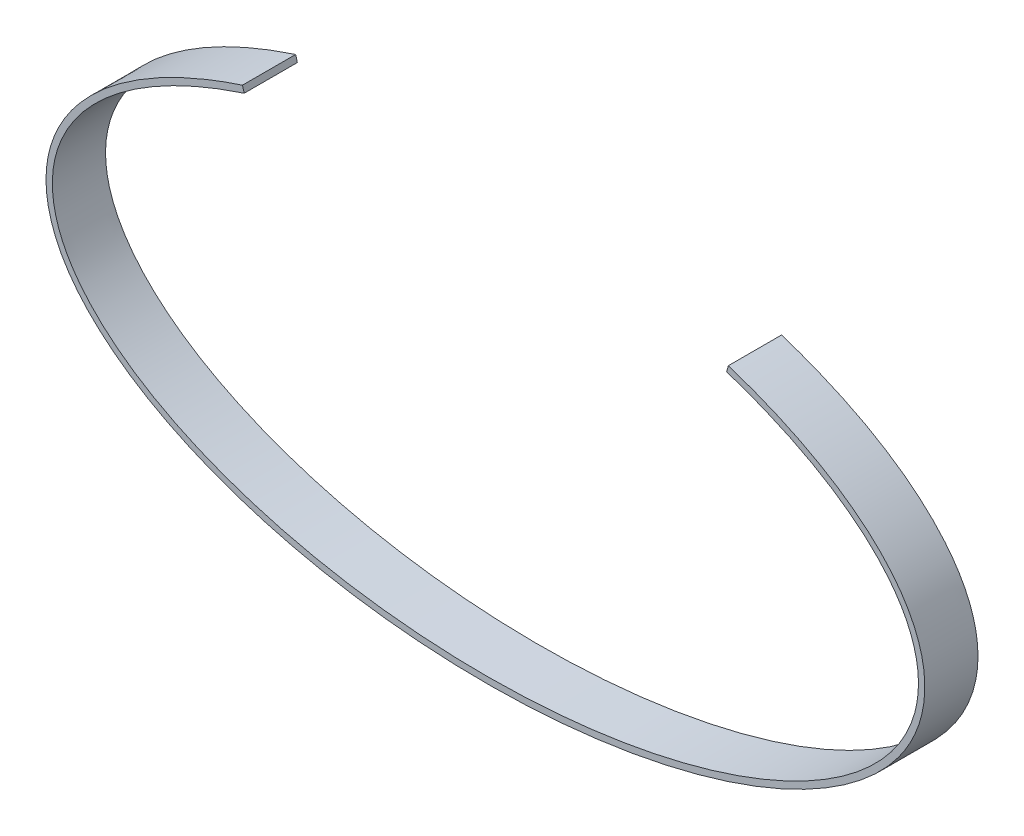
ISO-10303-21;
HEADER;
FILE_DESCRIPTION(('STEP AP214'),'2;1');
FILE_NAME('part.step','',(''),(''),'','','');
FILE_SCHEMA(('AUTOMOTIVE_DESIGN { 1 0 10303 214 1 1 1 1 }'));
ENDSEC;
DATA;
#1=APPLICATION_CONTEXT('core data for automotive mechanical design processes');
#2=APPLICATION_PROTOCOL_DEFINITION('international standard','automotive_design',2000,#1);
#3=PRODUCT_CONTEXT('',#1,'mechanical');
#4=PRODUCT('Part','Part','',(#3));
#5=PRODUCT_RELATED_PRODUCT_CATEGORY('part','',(#4));
#6=PRODUCT_DEFINITION_FORMATION('','',#4);
#7=PRODUCT_DEFINITION_CONTEXT('part definition',#1,'design');
#8=PRODUCT_DEFINITION('design','',#6,#7);
#9=PRODUCT_DEFINITION_SHAPE('','',#8);
#10=(LENGTH_UNIT() NAMED_UNIT(*) SI_UNIT(.MILLI.,.METRE.));
#11=(NAMED_UNIT(*) PLANE_ANGLE_UNIT() SI_UNIT($,.RADIAN.));
#12=(NAMED_UNIT(*) SI_UNIT($,.STERADIAN.) SOLID_ANGLE_UNIT());
#13=UNCERTAINTY_MEASURE_WITH_UNIT(LENGTH_MEASURE(1.E-05),#10,'distance_accuracy_value','');
#14=(GEOMETRIC_REPRESENTATION_CONTEXT(3) GLOBAL_UNCERTAINTY_ASSIGNED_CONTEXT((#13)) GLOBAL_UNIT_ASSIGNED_CONTEXT((#10,
#11,#12)) REPRESENTATION_CONTEXT('',''));
#15=CARTESIAN_POINT('',(0.,0.,0.));
#16=DIRECTION('',(0.,0.,1.));
#17=DIRECTION('',(1.,0.,0.));
#18=AXIS2_PLACEMENT_3D('',#15,#16,#17);
#19=CARTESIAN_POINT('',(22.6712230194547,18.0351357951931,5.));
#20=CARTESIAN_POINT('',(23.1244508687197,17.8875552362047,5.));
#21=CARTESIAN_POINT('',(23.57338151497,17.7350929178389,5.));
#22=CARTESIAN_POINT('',(24.4537774093582,17.4230232898924,5.));
#23=CARTESIAN_POINT('',(24.8858285439626,17.2632494265172,5.));
#24=CARTESIAN_POINT('',(26.1597332283695,16.7721659699781,5.));
#25=CARTESIAN_POINT('',(26.9805785009848,16.4286955420237,5.));
#26=CARTESIAN_POINT('',(29.3596017613618,15.3507912507727,5.));
#27=CARTESIAN_POINT('',(30.8297471816024,14.5701438243256,5.));
#28=CARTESIAN_POINT('',(34.8181438801696,12.0780162322035,5.));
#29=CARTESIAN_POINT('',(36.9182334441817,10.2139714392686,5.));
#30=CARTESIAN_POINT('',(39.0800518659044,7.26750831120165,5.));
#31=CARTESIAN_POINT('',(39.6373460145538,6.26091734109245,5.));
#32=CARTESIAN_POINT('',(40.414776524331,4.22586311014038,5.));
#33=CARTESIAN_POINT('',(40.6353699428487,3.19644394935072,5.));
#34=CARTESIAN_POINT('',(40.7415384284368,1.1322835493168,5.));
#35=CARTESIAN_POINT('',(40.6259718573775,0.0977228869266621,5.));
#36=CARTESIAN_POINT('',(40.0555236438091,-1.95052607881685,5.));
#37=CARTESIAN_POINT('',(39.6008544775974,-2.96429641785395,5.));
#38=CARTESIAN_POINT('',(37.7376407983355,-5.94873835389215,5.));
#39=CARTESIAN_POINT('',(35.836625242314,-7.86028728853731,5.));
#40=CARTESIAN_POINT('',(30.8680871579794,-11.3032590486715,5.));
#41=CARTESIAN_POINT('',(27.8064396630751,-12.8350281149432,5.));
#42=CARTESIAN_POINT('',(20.8401444541609,-15.3549118310755,5.));
#43=CARTESIAN_POINT('',(16.9384275688805,-16.3431734676818,5.));
#44=CARTESIAN_POINT('',(8.69009281811614,-17.6723450044211,5.));
#45=CARTESIAN_POINT('',(4.34542626583159,-18.0135393297491,5.));
#46=CARTESIAN_POINT('',(-4.34542626669103,-18.013539329749,5.));
#47=CARTESIAN_POINT('',(-8.69009281897026,-17.6723450044213,5.));
#48=CARTESIAN_POINT('',(-16.9384275697135,-16.3431734676818,5.));
#49=CARTESIAN_POINT('',(-20.8401444549785,-15.354911831076,5.));
#50=CARTESIAN_POINT('',(-27.8064396638526,-12.8350281149436,5.));
#51=CARTESIAN_POINT('',(-30.8680871587329,-11.3032590486724,5.));
#52=CARTESIAN_POINT('',(-35.836625243012,-7.86028728853864,5.));
#53=CARTESIAN_POINT('',(-37.7376407990035,-5.94873835389446,5.));
#54=CARTESIAN_POINT('',(-39.600854478218,-2.96429641785798,5.));
#55=CARTESIAN_POINT('',(-40.0555236444134,-1.95052607882131,5.));
#56=CARTESIAN_POINT('',(-40.6259718579495,0.097722886921961,5.));
#57=CARTESIAN_POINT('',(-40.7415384289924,1.13228354931211,5.));
#58=CARTESIAN_POINT('',(-40.6353699433723,3.19644394934589,5.));
#59=CARTESIAN_POINT('',(-40.4147765248387,4.22586311013568,5.));
#60=CARTESIAN_POINT('',(-39.6373460150292,6.26091734108862,5.));
#61=CARTESIAN_POINT('',(-39.0800518663639,7.26750831119842,5.));
#62=CARTESIAN_POINT('',(-36.9182334445943,10.2139714392667,5.));
#63=CARTESIAN_POINT('',(-34.8181438805525,12.0780162322021,5.));
#64=CARTESIAN_POINT('',(-30.8297471819453,14.5701438243249,5.));
#65=CARTESIAN_POINT('',(-29.3596017616921,15.3507912507722,5.));
#66=CARTESIAN_POINT('',(-26.9805785012987,16.4286955420231,5.));
#67=CARTESIAN_POINT('',(-26.1597332286786,16.7721659699773,5.));
#68=CARTESIAN_POINT('',(-24.885828544263,17.2632494265167,5.));
#69=CARTESIAN_POINT('',(-24.4537774096555,17.4230232898921,5.));
#70=CARTESIAN_POINT('',(-23.5733815152606,17.7350929178392,5.));
#71=CARTESIAN_POINT('',(-23.1244508690074,17.8875552362052,5.));
#72=CARTESIAN_POINT('',(-22.6712230197411,18.0351357951933,5.));
#73=B_SPLINE_CURVE_WITH_KNOTS('',3,(#19,#20,#21,#22,#23,#24,#25,#26,#27,#28,#29,#30,#31,#32,#33,
#34,#35,#36,#37,#38,#39,#40,#41,#42,#43,#44,#45,#46,#47,#48,#49,#50,#51,#52,#53,#54,#55,#56,#57,
#58,#59,#60,#61,#62,#63,#64,#65,#66,#67,#68,#69,#70,#71,#72),.UNSPECIFIED.,.F.,.F.,(4,2,2,2,2,2,
2,2,2,2,2,2,2,2,2,2,2,2,2,2,2,2,2,2,2,2,4),(0.,0.00781249999999989,0.0156249999999999,0.03125,
0.0625000000000001,0.125,0.15625,0.1875,0.21875,0.250000000000001,0.312500000000001,
0.375000000000001,0.4375,0.5,0.5625,0.625,0.6875,0.75,0.78125,0.8125,0.84375,0.875,0.9375,
0.96875,0.984375,0.9921875,1.),.UNSPECIFIED.);
#74=DIRECTION('',(0.,0.,-1.));
#75=VECTOR('',#74,1.);
#76=SURFACE_OF_LINEAR_EXTRUSION('',#73,#75);
#77=CARTESIAN_POINT('',(22.6712230194547,18.0351357951931,0.));
#78=CARTESIAN_POINT('',(23.1244508687197,17.8875552362047,0.));
#79=CARTESIAN_POINT('',(23.57338151497,17.7350929178389,0.));
#80=CARTESIAN_POINT('',(24.4537774093582,17.4230232898924,0.));
#81=CARTESIAN_POINT('',(24.8858285439626,17.2632494265172,0.));
#82=CARTESIAN_POINT('',(26.1597332283695,16.7721659699781,0.));
#83=CARTESIAN_POINT('',(26.9805785009848,16.4286955420237,0.));
#84=CARTESIAN_POINT('',(29.3596017613618,15.3507912507727,0.));
#85=CARTESIAN_POINT('',(30.8297471816024,14.5701438243256,0.));
#86=CARTESIAN_POINT('',(34.8181438801696,12.0780162322035,0.));
#87=CARTESIAN_POINT('',(36.9182334441817,10.2139714392686,0.));
#88=CARTESIAN_POINT('',(39.0800518659044,7.26750831120165,0.));
#89=CARTESIAN_POINT('',(39.6373460145538,6.26091734109245,0.));
#90=CARTESIAN_POINT('',(40.414776524331,4.22586311014038,0.));
#91=CARTESIAN_POINT('',(40.6353699428487,3.19644394935072,0.));
#92=CARTESIAN_POINT('',(40.7415384284368,1.1322835493168,0.));
#93=CARTESIAN_POINT('',(40.6259718573775,0.0977228869266621,0.));
#94=CARTESIAN_POINT('',(40.0555236438091,-1.95052607881685,0.));
#95=CARTESIAN_POINT('',(39.6008544775974,-2.96429641785395,0.));
#96=CARTESIAN_POINT('',(37.7376407983355,-5.94873835389215,0.));
#97=CARTESIAN_POINT('',(35.836625242314,-7.86028728853731,0.));
#98=CARTESIAN_POINT('',(30.8680871579794,-11.3032590486715,0.));
#99=CARTESIAN_POINT('',(27.8064396630751,-12.8350281149432,0.));
#100=CARTESIAN_POINT('',(20.8401444541609,-15.3549118310755,0.));
#101=CARTESIAN_POINT('',(16.9384275688805,-16.3431734676818,0.));
#102=CARTESIAN_POINT('',(8.69009281811614,-17.6723450044211,0.));
#103=CARTESIAN_POINT('',(4.34542626583159,-18.0135393297491,0.));
#104=CARTESIAN_POINT('',(-4.34542626669103,-18.013539329749,0.));
#105=CARTESIAN_POINT('',(-8.69009281897026,-17.6723450044213,0.));
#106=CARTESIAN_POINT('',(-16.9384275697135,-16.3431734676818,0.));
#107=CARTESIAN_POINT('',(-20.8401444549785,-15.354911831076,0.));
#108=CARTESIAN_POINT('',(-27.8064396638526,-12.8350281149436,0.));
#109=CARTESIAN_POINT('',(-30.8680871587329,-11.3032590486724,0.));
#110=CARTESIAN_POINT('',(-35.836625243012,-7.86028728853864,0.));
#111=CARTESIAN_POINT('',(-37.7376407990035,-5.94873835389446,0.));
#112=CARTESIAN_POINT('',(-39.600854478218,-2.96429641785798,0.));
#113=CARTESIAN_POINT('',(-40.0555236444134,-1.95052607882131,0.));
#114=CARTESIAN_POINT('',(-40.6259718579495,0.097722886921961,0.));
#115=CARTESIAN_POINT('',(-40.7415384289924,1.13228354931211,0.));
#116=CARTESIAN_POINT('',(-40.6353699433723,3.19644394934589,0.));
#117=CARTESIAN_POINT('',(-40.4147765248387,4.22586311013568,0.));
#118=CARTESIAN_POINT('',(-39.6373460150292,6.26091734108862,0.));
#119=CARTESIAN_POINT('',(-39.0800518663639,7.26750831119842,0.));
#120=CARTESIAN_POINT('',(-36.9182334445943,10.2139714392667,0.));
#121=CARTESIAN_POINT('',(-34.8181438805525,12.0780162322021,0.));
#122=CARTESIAN_POINT('',(-30.8297471819453,14.5701438243249,0.));
#123=CARTESIAN_POINT('',(-29.3596017616921,15.3507912507722,0.));
#124=CARTESIAN_POINT('',(-26.9805785012987,16.4286955420231,0.));
#125=CARTESIAN_POINT('',(-26.1597332286786,16.7721659699773,0.));
#126=CARTESIAN_POINT('',(-24.885828544263,17.2632494265167,0.));
#127=CARTESIAN_POINT('',(-24.4537774096555,17.4230232898921,0.));
#128=CARTESIAN_POINT('',(-23.5733815152606,17.7350929178392,0.));
#129=CARTESIAN_POINT('',(-23.1244508690074,17.8875552362052,0.));
#130=CARTESIAN_POINT('',(-22.6712230197411,18.0351357951933,0.));
#131=B_SPLINE_CURVE_WITH_KNOTS('',3,(#77,#78,#79,#80,#81,#82,#83,#84,#85,#86,#87,#88,#89,#90,
#91,#92,#93,#94,#95,#96,#97,#98,#99,#100,#101,#102,#103,#104,#105,#106,#107,#108,#109,#110,#111,
#112,#113,#114,#115,#116,#117,#118,#119,#120,#121,#122,#123,#124,#125,#126,#127,#128,#129,#130),
.UNSPECIFIED.,.F.,.F.,(4,2,2,2,2,2,2,2,2,2,2,2,2,2,2,2,2,2,2,2,2,2,2,2,2,2,4),(0.,
0.00781249999999989,0.0156249999999999,0.03125,0.0625000000000001,0.125,0.15625,0.1875,0.21875,
0.250000000000001,0.312500000000001,0.375000000000001,0.4375,0.5,0.5625,0.625,0.6875,0.75,
0.78125,0.8125,0.84375,0.875,0.9375,0.96875,0.984375,0.9921875,1.),.UNSPECIFIED.);
#132=CARTESIAN_POINT('',(22.6712230194548,18.0351357951931,0.));
#133=VERTEX_POINT('',#132);
#134=CARTESIAN_POINT('',(-22.6712230197411,18.0351357951933,0.));
#135=VERTEX_POINT('',#134);
#136=EDGE_CURVE('E200',#133,#135,#131,.T.);
#137=ORIENTED_EDGE('',*,*,#136,.T.);
#138=DIRECTION('',(0.,0.,-1.));
#139=VECTOR('',#138,1.);
#140=CARTESIAN_POINT('',(-22.6712230197411,18.0351357951933,5.));
#141=LINE('',#140,#139);
#142=CARTESIAN_POINT('',(-22.6712230197411,18.0351357951933,5.));
#143=VERTEX_POINT('',#142);
#144=EDGE_CURVE('E11',#143,#135,#141,.T.);
#145=ORIENTED_EDGE('',*,*,#144,.F.);
#146=CARTESIAN_POINT('',(-22.6712230197411,18.0351357951933,5.));
#147=CARTESIAN_POINT('',(-23.1244508690074,17.8875552362052,5.));
#148=CARTESIAN_POINT('',(-23.5733815152606,17.7350929178392,5.));
#149=CARTESIAN_POINT('',(-24.4537774096555,17.4230232898921,5.));
#150=CARTESIAN_POINT('',(-24.885828544263,17.2632494265167,5.));
#151=CARTESIAN_POINT('',(-26.1597332286786,16.7721659699773,5.));
#152=CARTESIAN_POINT('',(-26.9805785012987,16.4286955420231,5.));
#153=CARTESIAN_POINT('',(-29.3596017616921,15.3507912507722,5.));
#154=CARTESIAN_POINT('',(-30.8297471819453,14.5701438243249,5.));
#155=CARTESIAN_POINT('',(-34.8181438805525,12.0780162322021,5.));
#156=CARTESIAN_POINT('',(-36.9182334445943,10.2139714392667,5.));
#157=CARTESIAN_POINT('',(-39.0800518663639,7.26750831119842,5.));
#158=CARTESIAN_POINT('',(-39.6373460150292,6.26091734108862,5.));
#159=CARTESIAN_POINT('',(-40.4147765248387,4.22586311013568,5.));
#160=CARTESIAN_POINT('',(-40.6353699433723,3.19644394934589,5.));
#161=CARTESIAN_POINT('',(-40.7415384289924,1.13228354931211,5.));
#162=CARTESIAN_POINT('',(-40.6259718579495,0.097722886921961,5.));
#163=CARTESIAN_POINT('',(-40.0555236444134,-1.95052607882131,5.));
#164=CARTESIAN_POINT('',(-39.600854478218,-2.96429641785798,5.));
#165=CARTESIAN_POINT('',(-37.7376407990035,-5.94873835389446,5.));
#166=CARTESIAN_POINT('',(-35.836625243012,-7.86028728853864,5.));
#167=CARTESIAN_POINT('',(-30.8680871587329,-11.3032590486724,5.));
#168=CARTESIAN_POINT('',(-27.8064396638526,-12.8350281149436,5.));
#169=CARTESIAN_POINT('',(-20.8401444549785,-15.354911831076,5.));
#170=CARTESIAN_POINT('',(-16.9384275697135,-16.3431734676818,5.));
#171=CARTESIAN_POINT('',(-8.69009281897026,-17.6723450044213,5.));
#172=CARTESIAN_POINT('',(-4.34542626669103,-18.013539329749,5.));
#173=CARTESIAN_POINT('',(4.34542626583159,-18.0135393297491,5.));
#174=CARTESIAN_POINT('',(8.69009281811614,-17.6723450044211,5.));
#175=CARTESIAN_POINT('',(16.9384275688805,-16.3431734676818,5.));
#176=CARTESIAN_POINT('',(20.8401444541609,-15.3549118310755,5.));
#177=CARTESIAN_POINT('',(27.8064396630751,-12.8350281149432,5.));
#178=CARTESIAN_POINT('',(30.8680871579794,-11.3032590486715,5.));
#179=CARTESIAN_POINT('',(35.836625242314,-7.86028728853731,5.));
#180=CARTESIAN_POINT('',(37.7376407983355,-5.94873835389215,5.));
#181=CARTESIAN_POINT('',(39.6008544775974,-2.96429641785395,5.));
#182=CARTESIAN_POINT('',(40.0555236438091,-1.95052607881685,5.));
#183=CARTESIAN_POINT('',(40.6259718573775,0.0977228869266621,5.));
#184=CARTESIAN_POINT('',(40.7415384284368,1.1322835493168,5.));
#185=CARTESIAN_POINT('',(40.6353699428487,3.19644394935072,5.));
#186=CARTESIAN_POINT('',(40.414776524331,4.22586311014038,5.));
#187=CARTESIAN_POINT('',(39.6373460145538,6.26091734109245,5.));
#188=CARTESIAN_POINT('',(39.0800518659044,7.26750831120165,5.));
#189=CARTESIAN_POINT('',(36.9182334441817,10.2139714392686,5.));
#190=CARTESIAN_POINT('',(34.8181438801696,12.0780162322035,5.));
#191=CARTESIAN_POINT('',(30.8297471816024,14.5701438243256,5.));
#192=CARTESIAN_POINT('',(29.3596017613618,15.3507912507727,5.));
#193=CARTESIAN_POINT('',(26.9805785009848,16.4286955420237,5.));
#194=CARTESIAN_POINT('',(26.1597332283695,16.7721659699781,5.));
#195=CARTESIAN_POINT('',(24.8858285439626,17.2632494265172,5.));
#196=CARTESIAN_POINT('',(24.4537774093582,17.4230232898924,5.));
#197=CARTESIAN_POINT('',(23.57338151497,17.7350929178389,5.));
#198=CARTESIAN_POINT('',(23.1244508687197,17.8875552362047,5.));
#199=CARTESIAN_POINT('',(22.6712230194547,18.0351357951931,5.));
#200=B_SPLINE_CURVE_WITH_KNOTS('',3,(#146,#147,#148,#149,#150,#151,#152,#153,#154,#155,#156,
#157,#158,#159,#160,#161,#162,#163,#164,#165,#166,#167,#168,#169,#170,#171,#172,#173,#174,#175,
#176,#177,#178,#179,#180,#181,#182,#183,#184,#185,#186,#187,#188,#189,#190,#191,#192,#193,#194,
#195,#196,#197,#198,#199),.UNSPECIFIED.,.F.,.F.,(4,2,2,2,2,2,2,2,2,2,2,2,2,2,2,2,2,2,2,2,2,2,2,
2,2,2,4),(0.,0.0078125,0.015625,0.03125,0.0625,0.125,0.15625,0.1875,0.21875,0.25,0.3125,0.375,
0.4375,0.5,0.5625,0.624999999999999,0.687499999999999,0.749999999999999,0.78125,0.8125,0.84375,
0.875,0.9375,0.96875,0.984375,0.9921875,1.),.UNSPECIFIED.);
#201=CARTESIAN_POINT('',(22.6712230194548,18.0351357951931,5.));
#202=VERTEX_POINT('',#201);
#203=EDGE_CURVE('E97',#202,#143,#200,.F.);
#204=ORIENTED_EDGE('',*,*,#203,.F.);
#205=DIRECTION('',(0.,0.,-1.));
#206=VECTOR('',#205,1.);
#207=CARTESIAN_POINT('',(22.6712230194548,18.0351357951931,5.));
#208=LINE('',#207,#206);
#209=EDGE_CURVE('E185',#202,#133,#208,.T.);
#210=ORIENTED_EDGE('',*,*,#209,.T.);
#211=EDGE_LOOP('',(#137,#145,#204,#210));
#212=FACE_BOUND('',#211,.T.);
#213=ADVANCED_FACE('F37',(#212),#76,.F.);
#214=CARTESIAN_POINT('',(-22.8326998065958,18.6135575800608,5.));
#215=DIRECTION('',(-0.963171829425623,-0.268886643403681,0.));
#216=DIRECTION('',(0.268886643403681,-0.963171829425623,0.));
#217=AXIS2_PLACEMENT_3D('',#214,#215,#216);
#218=PLANE('',#217);
#219=DIRECTION('',(-0.268886643403681,0.963171829425623,0.));
#220=VECTOR('',#219,1.);
#221=CARTESIAN_POINT('',(-22.8326998065958,18.6135575800608,0.));
#222=LINE('',#221,#220);
#223=CARTESIAN_POINT('',(-22.8326998065958,18.6135575800608,0.));
#224=VERTEX_POINT('',#223);
#225=EDGE_CURVE('E103',#135,#224,#222,.T.);
#226=ORIENTED_EDGE('',*,*,#225,.T.);
#227=DIRECTION('',(0.,0.,-1.));
#228=VECTOR('',#227,1.);
#229=CARTESIAN_POINT('',(-22.8326998065958,18.6135575800608,5.));
#230=LINE('',#229,#228);
#231=CARTESIAN_POINT('',(-22.8326998065958,18.6135575800608,5.));
#232=VERTEX_POINT('',#231);
#233=EDGE_CURVE('E51',#232,#224,#230,.T.);
#234=ORIENTED_EDGE('',*,*,#233,.F.);
#235=DIRECTION('',(-0.268886643403681,0.963171829425623,0.));
#236=VECTOR('',#235,1.);
#237=CARTESIAN_POINT('',(-22.8326998065958,18.6135575800608,5.));
#238=LINE('',#237,#236);
#239=EDGE_CURVE('E91',#143,#232,#238,.T.);
#240=ORIENTED_EDGE('',*,*,#239,.F.);
#241=ORIENTED_EDGE('',*,*,#144,.T.);
#242=EDGE_LOOP('',(#226,#234,#240,#241));
#243=FACE_BOUND('',#242,.T.);
#244=ADVANCED_FACE('F102',(#243),#218,.F.);
#245=CARTESIAN_POINT('',(-22.8326998065958,18.6135575800608,5.));
#246=CARTESIAN_POINT('',(-23.2914949610284,18.4644246822641,5.));
#247=CARTESIAN_POINT('',(-23.7450782917098,18.3106059955309,5.));
#248=CARTESIAN_POINT('',(-24.6349478304566,17.9956096946415,5.));
#249=CARTESIAN_POINT('',(-25.0720375811472,17.8341999250831,5.));
#250=CARTESIAN_POINT('',(-26.36193090997,17.3376691799352,5.));
#251=CARTESIAN_POINT('',(-27.1947041469082,16.9898199586931,5.));
#252=CARTESIAN_POINT('',(-29.6095527046074,15.8973495510768,5.));
#253=CARTESIAN_POINT('',(-31.1043413942103,15.1048732341323,5.));
#254=CARTESIAN_POINT('',(-35.172152256445,12.5667064645001,5.));
#255=CARTESIAN_POINT('',(-37.3343247082252,10.6571959774871,5.));
#256=CARTESIAN_POINT('',(-39.585504015268,7.59480189420781,5.));
#257=CARTESIAN_POINT('',(-40.1712433988066,6.54130457546535,5.));
#258=CARTESIAN_POINT('',(-40.9945022655138,4.39304497045475,5.));
#259=CARTESIAN_POINT('',(-41.2312726400768,3.30097360552665,5.));
#260=CARTESIAN_POINT('',(-41.3935706562625,0.0182312930631714,5.));
#261=CARTESIAN_POINT('',(-40.7838346445003,-2.18847171613706,5.));
#262=CARTESIAN_POINT('',(-38.2077424420539,-6.35009722451461,5.));
#263=CARTESIAN_POINT('',(-36.2388055097073,-8.31214429879822,5.));
#264=CARTESIAN_POINT('',(-31.1618034980879,-11.8282366564591,5.));
#265=CARTESIAN_POINT('',(-28.0566027167008,-13.3819764518012,5.));
#266=CARTESIAN_POINT('',(-21.0110585870468,-15.9317956238827,5.));
#267=CARTESIAN_POINT('',(-17.0716914282485,-16.929320901034,5.));
#268=CARTESIAN_POINT('',(-8.75517876554966,-18.2697392884364,5.));
#269=CARTESIAN_POINT('',(-4.37725485334024,-18.6135575800608,5.));
#270=CARTESIAN_POINT('',(4.37725485362286,-18.6135575800608,5.));
#271=CARTESIAN_POINT('',(8.75517876582717,-18.269739288437,5.));
#272=CARTESIAN_POINT('',(17.0716914285053,-16.9293209010346,5.));
#273=CARTESIAN_POINT('',(21.0110585872888,-15.9317956238836,5.));
#274=CARTESIAN_POINT('',(28.0566027169034,-13.3819764518021,5.));
#275=CARTESIAN_POINT('',(31.1618034982674,-11.8282366564599,5.));
#276=CARTESIAN_POINT('',(36.2388055098335,-8.31214429879855,5.));
#277=CARTESIAN_POINT('',(38.2077424421504,-6.35009722451452,5.));
#278=CARTESIAN_POINT('',(40.7838346445328,-2.18847171613469,5.));
#279=CARTESIAN_POINT('',(41.3935706562625,0.0182312930661448,5.));
#280=CARTESIAN_POINT('',(41.2312726400256,3.30097360552901,5.));
#281=CARTESIAN_POINT('',(40.9945022654453,4.39304497045737,5.));
#282=CARTESIAN_POINT('',(40.1712433987052,6.54130457546717,5.));
#283=CARTESIAN_POINT('',(39.5855040151507,7.59480189420901,5.));
#284=CARTESIAN_POINT('',(37.3343247080615,10.6571959774871,5.));
#285=CARTESIAN_POINT('',(35.1721522562527,12.5667064644997,5.));
#286=CARTESIAN_POINT('',(31.1043413939792,15.1048732341316,5.));
#287=CARTESIAN_POINT('',(29.609552704364,15.897349551076,5.));
#288=CARTESIAN_POINT('',(27.1947041466489,16.9898199586921,5.));
#289=CARTESIAN_POINT('',(26.361930909706,17.3376691799341,5.));
#290=CARTESIAN_POINT('',(25.072037580875,17.8341999250822,5.));
#291=CARTESIAN_POINT('',(24.6349478301815,17.9956096946407,5.));
#292=CARTESIAN_POINT('',(23.7450782914285,18.3106059955305,5.));
#293=CARTESIAN_POINT('',(23.2914949607437,18.464424682264,5.));
#294=CARTESIAN_POINT('',(22.8326998063094,18.6135575800606,5.));
#295=B_SPLINE_CURVE_WITH_KNOTS('',3,(#245,#246,#247,#248,#249,#250,#251,#252,#253,#254,#255,
#256,#257,#258,#259,#260,#261,#262,#263,#264,#265,#266,#267,#268,#269,#270,#271,#272,#273,#274,
#275,#276,#277,#278,#279,#280,#281,#282,#283,#284,#285,#286,#287,#288,#289,#290,#291,#292,#293,
#294),.UNSPECIFIED.,.F.,.F.,(4,2,2,2,2,2,2,2,2,2,2,2,2,2,2,2,2,2,2,2,2,2,2,2,4),(0.,0.0078125,
0.015625,0.03125,0.0625,0.125,0.15625,0.1875,0.25,0.3125,0.375,0.4375,0.5,0.5625,0.625,0.6875,
0.75,0.8125,0.84375,0.875,0.9375,0.96875,0.984375,0.9921875,1.),.UNSPECIFIED.);
#296=DIRECTION('',(0.,0.,-1.));
#297=VECTOR('',#296,1.);
#298=SURFACE_OF_LINEAR_EXTRUSION('',#295,#297);
#299=CARTESIAN_POINT('',(-22.8326998065958,18.6135575800608,0.));
#300=CARTESIAN_POINT('',(-23.2914949610284,18.4644246822641,0.));
#301=CARTESIAN_POINT('',(-23.7450782917098,18.3106059955309,0.));
#302=CARTESIAN_POINT('',(-24.6349478304566,17.9956096946415,0.));
#303=CARTESIAN_POINT('',(-25.0720375811472,17.8341999250831,0.));
#304=CARTESIAN_POINT('',(-26.36193090997,17.3376691799352,0.));
#305=CARTESIAN_POINT('',(-27.1947041469082,16.9898199586931,0.));
#306=CARTESIAN_POINT('',(-29.6095527046074,15.8973495510768,0.));
#307=CARTESIAN_POINT('',(-31.1043413942103,15.1048732341323,0.));
#308=CARTESIAN_POINT('',(-35.172152256445,12.5667064645001,0.));
#309=CARTESIAN_POINT('',(-37.3343247082252,10.6571959774871,0.));
#310=CARTESIAN_POINT('',(-39.585504015268,7.59480189420781,0.));
#311=CARTESIAN_POINT('',(-40.1712433988066,6.54130457546535,0.));
#312=CARTESIAN_POINT('',(-40.9945022655138,4.39304497045475,0.));
#313=CARTESIAN_POINT('',(-41.2312726400768,3.30097360552665,0.));
#314=CARTESIAN_POINT('',(-41.3935706562625,0.0182312930631714,0.));
#315=CARTESIAN_POINT('',(-40.7838346445003,-2.18847171613706,0.));
#316=CARTESIAN_POINT('',(-38.2077424420539,-6.35009722451461,0.));
#317=CARTESIAN_POINT('',(-36.2388055097073,-8.31214429879822,0.));
#318=CARTESIAN_POINT('',(-31.1618034980879,-11.8282366564591,0.));
#319=CARTESIAN_POINT('',(-28.0566027167008,-13.3819764518012,0.));
#320=CARTESIAN_POINT('',(-21.0110585870468,-15.9317956238827,0.));
#321=CARTESIAN_POINT('',(-17.0716914282485,-16.929320901034,0.));
#322=CARTESIAN_POINT('',(-8.75517876554966,-18.2697392884364,0.));
#323=CARTESIAN_POINT('',(-4.37725485334024,-18.6135575800608,0.));
#324=CARTESIAN_POINT('',(4.37725485362286,-18.6135575800608,0.));
#325=CARTESIAN_POINT('',(8.75517876582717,-18.269739288437,0.));
#326=CARTESIAN_POINT('',(17.0716914285053,-16.9293209010346,0.));
#327=CARTESIAN_POINT('',(21.0110585872888,-15.9317956238836,0.));
#328=CARTESIAN_POINT('',(28.0566027169034,-13.3819764518021,0.));
#329=CARTESIAN_POINT('',(31.1618034982674,-11.8282366564599,0.));
#330=CARTESIAN_POINT('',(36.2388055098335,-8.31214429879855,0.));
#331=CARTESIAN_POINT('',(38.2077424421504,-6.35009722451452,0.));
#332=CARTESIAN_POINT('',(40.7838346445328,-2.18847171613469,0.));
#333=CARTESIAN_POINT('',(41.3935706562625,0.0182312930661448,0.));
#334=CARTESIAN_POINT('',(41.2312726400256,3.30097360552901,0.));
#335=CARTESIAN_POINT('',(40.9945022654453,4.39304497045737,0.));
#336=CARTESIAN_POINT('',(40.1712433987052,6.54130457546717,0.));
#337=CARTESIAN_POINT('',(39.5855040151507,7.59480189420901,0.));
#338=CARTESIAN_POINT('',(37.3343247080615,10.6571959774871,0.));
#339=CARTESIAN_POINT('',(35.1721522562527,12.5667064644997,0.));
#340=CARTESIAN_POINT('',(31.1043413939792,15.1048732341316,0.));
#341=CARTESIAN_POINT('',(29.609552704364,15.897349551076,0.));
#342=CARTESIAN_POINT('',(27.1947041466489,16.9898199586921,0.));
#343=CARTESIAN_POINT('',(26.361930909706,17.3376691799341,0.));
#344=CARTESIAN_POINT('',(25.072037580875,17.8341999250822,0.));
#345=CARTESIAN_POINT('',(24.6349478301815,17.9956096946407,0.));
#346=CARTESIAN_POINT('',(23.7450782914285,18.3106059955305,0.));
#347=CARTESIAN_POINT('',(23.2914949607437,18.464424682264,0.));
#348=CARTESIAN_POINT('',(22.8326998063094,18.6135575800606,0.));
#349=B_SPLINE_CURVE_WITH_KNOTS('',3,(#299,#300,#301,#302,#303,#304,#305,#306,#307,#308,#309,
#310,#311,#312,#313,#314,#315,#316,#317,#318,#319,#320,#321,#322,#323,#324,#325,#326,#327,#328,
#329,#330,#331,#332,#333,#334,#335,#336,#337,#338,#339,#340,#341,#342,#343,#344,#345,#346,#347,
#348),.UNSPECIFIED.,.F.,.F.,(4,2,2,2,2,2,2,2,2,2,2,2,2,2,2,2,2,2,2,2,2,2,2,2,4),(0.,0.0078125,
0.015625,0.03125,0.0625,0.125,0.15625,0.1875,0.25,0.3125,0.375,0.4375,0.5,0.5625,0.625,0.6875,
0.75,0.8125,0.84375,0.875,0.9375,0.96875,0.984375,0.9921875,1.),.UNSPECIFIED.);
#350=CARTESIAN_POINT('',(22.8326998063094,18.6135575800606,0.));
#351=VERTEX_POINT('',#350);
#352=EDGE_CURVE('E77',#224,#351,#349,.T.);
#353=ORIENTED_EDGE('',*,*,#352,.T.);
#354=DIRECTION('',(0.,0.,-1.));
#355=VECTOR('',#354,1.);
#356=CARTESIAN_POINT('',(22.8326998063094,18.6135575800606,5.));
#357=LINE('',#356,#355);
#358=CARTESIAN_POINT('',(22.8326998063094,18.6135575800606,5.));
#359=VERTEX_POINT('',#358);
#360=EDGE_CURVE('E105',#359,#351,#357,.T.);
#361=ORIENTED_EDGE('',*,*,#360,.F.);
#362=CARTESIAN_POINT('',(22.8326998063094,18.6135575800606,5.));
#363=CARTESIAN_POINT('',(23.2914949607437,18.464424682264,5.));
#364=CARTESIAN_POINT('',(23.7450782914285,18.3106059955305,5.));
#365=CARTESIAN_POINT('',(24.6349478301815,17.9956096946407,5.));
#366=CARTESIAN_POINT('',(25.072037580875,17.8341999250822,5.));
#367=CARTESIAN_POINT('',(26.361930909706,17.3376691799341,5.));
#368=CARTESIAN_POINT('',(27.1947041466489,16.9898199586921,5.));
#369=CARTESIAN_POINT('',(29.609552704364,15.897349551076,5.));
#370=CARTESIAN_POINT('',(31.1043413939792,15.1048732341316,5.));
#371=CARTESIAN_POINT('',(35.1721522562527,12.5667064644997,5.));
#372=CARTESIAN_POINT('',(37.3343247080615,10.6571959774871,5.));
#373=CARTESIAN_POINT('',(39.5855040151507,7.59480189420901,5.));
#374=CARTESIAN_POINT('',(40.1712433987052,6.54130457546717,5.));
#375=CARTESIAN_POINT('',(40.9945022654453,4.39304497045737,5.));
#376=CARTESIAN_POINT('',(41.2312726400256,3.30097360552901,5.));
#377=CARTESIAN_POINT('',(41.3935706562625,0.0182312930661448,5.));
#378=CARTESIAN_POINT('',(40.7838346445328,-2.18847171613469,5.));
#379=CARTESIAN_POINT('',(38.2077424421504,-6.35009722451452,5.));
#380=CARTESIAN_POINT('',(36.2388055098335,-8.31214429879855,5.));
#381=CARTESIAN_POINT('',(31.1618034982674,-11.8282366564599,5.));
#382=CARTESIAN_POINT('',(28.0566027169034,-13.3819764518021,5.));
#383=CARTESIAN_POINT('',(21.0110585872888,-15.9317956238836,5.));
#384=CARTESIAN_POINT('',(17.0716914285053,-16.9293209010346,5.));
#385=CARTESIAN_POINT('',(8.75517876582717,-18.269739288437,5.));
#386=CARTESIAN_POINT('',(4.37725485362286,-18.6135575800608,5.));
#387=CARTESIAN_POINT('',(-4.37725485334024,-18.6135575800608,5.));
#388=CARTESIAN_POINT('',(-8.75517876554966,-18.2697392884364,5.));
#389=CARTESIAN_POINT('',(-17.0716914282485,-16.929320901034,5.));
#390=CARTESIAN_POINT('',(-21.0110585870468,-15.9317956238827,5.));
#391=CARTESIAN_POINT('',(-28.0566027167008,-13.3819764518012,5.));
#392=CARTESIAN_POINT('',(-31.1618034980879,-11.8282366564591,5.));
#393=CARTESIAN_POINT('',(-36.2388055097073,-8.31214429879822,5.));
#394=CARTESIAN_POINT('',(-38.2077424420539,-6.35009722451461,5.));
#395=CARTESIAN_POINT('',(-40.7838346445003,-2.18847171613706,5.));
#396=CARTESIAN_POINT('',(-41.3935706562625,0.0182312930631714,5.));
#397=CARTESIAN_POINT('',(-41.2312726400768,3.30097360552665,5.));
#398=CARTESIAN_POINT('',(-40.9945022655138,4.39304497045475,5.));
#399=CARTESIAN_POINT('',(-40.1712433988066,6.54130457546535,5.));
#400=CARTESIAN_POINT('',(-39.585504015268,7.59480189420781,5.));
#401=CARTESIAN_POINT('',(-37.3343247082252,10.6571959774871,5.));
#402=CARTESIAN_POINT('',(-35.172152256445,12.5667064645001,5.));
#403=CARTESIAN_POINT('',(-31.1043413942103,15.1048732341323,5.));
#404=CARTESIAN_POINT('',(-29.6095527046074,15.8973495510768,5.));
#405=CARTESIAN_POINT('',(-27.1947041469082,16.9898199586931,5.));
#406=CARTESIAN_POINT('',(-26.36193090997,17.3376691799352,5.));
#407=CARTESIAN_POINT('',(-25.0720375811472,17.8341999250831,5.));
#408=CARTESIAN_POINT('',(-24.6349478304566,17.9956096946415,5.));
#409=CARTESIAN_POINT('',(-23.7450782917098,18.3106059955309,5.));
#410=CARTESIAN_POINT('',(-23.2914949610284,18.4644246822641,5.));
#411=CARTESIAN_POINT('',(-22.8326998065958,18.6135575800608,5.));
#412=B_SPLINE_CURVE_WITH_KNOTS('',3,(#362,#363,#364,#365,#366,#367,#368,#369,#370,#371,#372,
#373,#374,#375,#376,#377,#378,#379,#380,#381,#382,#383,#384,#385,#386,#387,#388,#389,#390,#391,
#392,#393,#394,#395,#396,#397,#398,#399,#400,#401,#402,#403,#404,#405,#406,#407,#408,#409,#410,
#411),.UNSPECIFIED.,.F.,.F.,(4,2,2,2,2,2,2,2,2,2,2,2,2,2,2,2,2,2,2,2,2,2,2,2,4),(0.,0.0078125,
0.015625,0.03125,0.0625,0.125,0.15625,0.1875,0.25,0.3125,0.375,0.4375,0.5,0.5625,0.625,0.6875,
0.75,0.8125,0.84375,0.875,0.9375,0.96875,0.984375,0.9921875,1.),.UNSPECIFIED.);
#413=EDGE_CURVE('E94',#232,#359,#412,.F.);
#414=ORIENTED_EDGE('',*,*,#413,.F.);
#415=ORIENTED_EDGE('',*,*,#233,.T.);
#416=EDGE_LOOP('',(#353,#361,#414,#415));
#417=FACE_BOUND('',#416,.T.);
#418=ADVANCED_FACE('F108',(#417),#298,.F.);
#419=CARTESIAN_POINT('',(22.8326998063095,18.6135575800606,5.));
#420=DIRECTION('',(0.963171829425614,-0.268886643403714,0.));
#421=DIRECTION('',(0.268886643403714,0.963171829425614,0.));
#422=AXIS2_PLACEMENT_3D('',#419,#420,#421);
#423=PLANE('',#422);
#424=DIRECTION('',(-0.268886643403714,-0.963171829425614,0.));
#425=VECTOR('',#424,1.);
#426=CARTESIAN_POINT('',(22.8326998063095,18.6135575800606,0.));
#427=LINE('',#426,#425);
#428=EDGE_CURVE('E84',#351,#133,#427,.T.);
#429=ORIENTED_EDGE('',*,*,#428,.T.);
#430=ORIENTED_EDGE('',*,*,#209,.F.);
#431=DIRECTION('',(-0.268886643403714,-0.963171829425614,0.));
#432=VECTOR('',#431,1.);
#433=CARTESIAN_POINT('',(22.8326998063095,18.6135575800606,5.));
#434=LINE('',#433,#432);
#435=EDGE_CURVE('E60',#359,#202,#434,.T.);
#436=ORIENTED_EDGE('',*,*,#435,.F.);
#437=ORIENTED_EDGE('',*,*,#360,.T.);
#438=EDGE_LOOP('',(#429,#430,#436,#437));
#439=FACE_BOUND('',#438,.T.);
#440=ADVANCED_FACE('F128',(#439),#423,.F.);
#441=CARTESIAN_POINT('',(-4.29627084373765E-10,-18.0135393297491,5.));
#442=DIRECTION('',(0.,0.,-1.));
#443=DIRECTION('',(-1.,0.,0.));
#444=AXIS2_PLACEMENT_3D('',#441,#442,#443);
#445=PLANE('',#444);
#446=ORIENTED_EDGE('',*,*,#203,.T.);
#447=ORIENTED_EDGE('',*,*,#239,.T.);
#448=ORIENTED_EDGE('',*,*,#413,.T.);
#449=ORIENTED_EDGE('',*,*,#435,.T.);
#450=EDGE_LOOP('',(#446,#447,#448,#449));
#451=FACE_BOUND('',#450,.T.);
#452=ADVANCED_FACE('F92',(#451),#445,.F.);
#453=CARTESIAN_POINT('',(-4.29627084373765E-10,-18.0135393297491,0.));
#454=DIRECTION('',(0.,0.,-1.));
#455=DIRECTION('',(-1.,0.,0.));
#456=AXIS2_PLACEMENT_3D('',#453,#454,#455);
#457=PLANE('',#456);
#458=ORIENTED_EDGE('',*,*,#136,.F.);
#459=ORIENTED_EDGE('',*,*,#428,.F.);
#460=ORIENTED_EDGE('',*,*,#352,.F.);
#461=ORIENTED_EDGE('',*,*,#225,.F.);
#462=EDGE_LOOP('',(#458,#459,#460,#461));
#463=FACE_BOUND('',#462,.T.);
#464=ADVANCED_FACE('F158',(#463),#457,.T.);
#465=CLOSED_SHELL('',(#213,#244,#418,#440,#452,#464));
#466=MANIFOLD_SOLID_BREP('B2',#465);
#467=ADVANCED_BREP_SHAPE_REPRESENTATION('',(#18,#466),#14);
#468=SHAPE_DEFINITION_REPRESENTATION(#9,#467);
ENDSEC;
END-ISO-10303-21;
